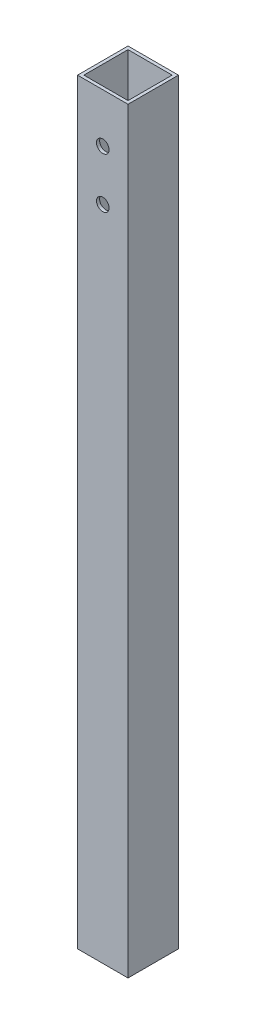
ISO-10303-21;
HEADER;
FILE_DESCRIPTION(('STEP AP214'),'2;1');
FILE_NAME('part.step','',(''),(''),'','','');
FILE_SCHEMA(('AUTOMOTIVE_DESIGN { 1 0 10303 214 1 1 1 1 }'));
ENDSEC;
DATA;
#1=APPLICATION_CONTEXT('core data for automotive mechanical design processes');
#2=APPLICATION_PROTOCOL_DEFINITION('international standard','automotive_design',2000,#1);
#3=PRODUCT_CONTEXT('',#1,'mechanical');
#4=PRODUCT('Part','Part','',(#3));
#5=PRODUCT_RELATED_PRODUCT_CATEGORY('part','',(#4));
#6=PRODUCT_DEFINITION_FORMATION('','',#4);
#7=PRODUCT_DEFINITION_CONTEXT('part definition',#1,'design');
#8=PRODUCT_DEFINITION('design','',#6,#7);
#9=PRODUCT_DEFINITION_SHAPE('','',#8);
#10=(LENGTH_UNIT() NAMED_UNIT(*) SI_UNIT(.MILLI.,.METRE.));
#11=(NAMED_UNIT(*) PLANE_ANGLE_UNIT() SI_UNIT($,.RADIAN.));
#12=(NAMED_UNIT(*) SI_UNIT($,.STERADIAN.) SOLID_ANGLE_UNIT());
#13=UNCERTAINTY_MEASURE_WITH_UNIT(LENGTH_MEASURE(1.E-05),#10,'distance_accuracy_value','');
#14=(GEOMETRIC_REPRESENTATION_CONTEXT(3) GLOBAL_UNCERTAINTY_ASSIGNED_CONTEXT((#13)) GLOBAL_UNIT_ASSIGNED_CONTEXT((#10,
#11,#12)) REPRESENTATION_CONTEXT('',''));
#15=CARTESIAN_POINT('',(0.,0.,0.));
#16=DIRECTION('',(0.,0.,1.));
#17=DIRECTION('',(1.,0.,0.));
#18=AXIS2_PLACEMENT_3D('',#15,#16,#17);
#19=CARTESIAN_POINT('',(0.,381.,0.));
#20=DIRECTION('',(0.,1.,0.));
#21=DIRECTION('',(0.,0.,1.));
#22=AXIS2_PLACEMENT_3D('',#19,#20,#21);
#23=PLANE('',#22);
#24=DIRECTION('',(0.,0.,-1.));
#25=VECTOR('',#24,1.);
#26=CARTESIAN_POINT('',(12.7,381.,-12.7));
#27=LINE('',#26,#25);
#28=CARTESIAN_POINT('',(12.7,381.,12.7));
#29=VERTEX_POINT('',#28);
#30=CARTESIAN_POINT('',(12.7,381.,-12.7));
#31=VERTEX_POINT('',#30);
#32=EDGE_CURVE('E139',#29,#31,#27,.T.);
#33=ORIENTED_EDGE('',*,*,#32,.T.);
#34=DIRECTION('',(-1.,0.,0.));
#35=VECTOR('',#34,1.);
#36=CARTESIAN_POINT('',(-12.7,381.,-12.7));
#37=LINE('',#36,#35);
#38=CARTESIAN_POINT('',(-12.7,381.,-12.7));
#39=VERTEX_POINT('',#38);
#40=EDGE_CURVE('E142',#31,#39,#37,.T.);
#41=ORIENTED_EDGE('',*,*,#40,.T.);
#42=DIRECTION('',(0.,0.,1.));
#43=VECTOR('',#42,1.);
#44=CARTESIAN_POINT('',(-12.7,381.,-12.7));
#45=LINE('',#44,#43);
#46=CARTESIAN_POINT('',(-12.7,381.,12.7));
#47=VERTEX_POINT('',#46);
#48=EDGE_CURVE('E145',#39,#47,#45,.T.);
#49=ORIENTED_EDGE('',*,*,#48,.T.);
#50=DIRECTION('',(1.,0.,0.));
#51=VECTOR('',#50,1.);
#52=CARTESIAN_POINT('',(-12.7,381.,12.7));
#53=LINE('',#52,#51);
#54=EDGE_CURVE('E147',#47,#29,#53,.T.);
#55=ORIENTED_EDGE('',*,*,#54,.T.);
#56=EDGE_LOOP('',(#33,#41,#49,#55));
#57=FACE_BOUND('',#56,.T.);
#58=DIRECTION('',(1.,0.,0.));
#59=VECTOR('',#58,1.);
#60=CARTESIAN_POINT('',(-11.1125,381.,11.1125));
#61=LINE('',#60,#59);
#62=CARTESIAN_POINT('',(-11.1125,381.,11.1125));
#63=VERTEX_POINT('',#62);
#64=CARTESIAN_POINT('',(11.1125,381.,11.1125));
#65=VERTEX_POINT('',#64);
#66=EDGE_CURVE('E109',#63,#65,#61,.T.);
#67=ORIENTED_EDGE('',*,*,#66,.F.);
#68=DIRECTION('',(0.,0.,1.));
#69=VECTOR('',#68,1.);
#70=CARTESIAN_POINT('',(-11.1125,381.,-11.1125));
#71=LINE('',#70,#69);
#72=CARTESIAN_POINT('',(-11.1125,381.,-11.1125));
#73=VERTEX_POINT('',#72);
#74=EDGE_CURVE('E101',#73,#63,#71,.T.);
#75=ORIENTED_EDGE('',*,*,#74,.F.);
#76=DIRECTION('',(-1.,0.,0.));
#77=VECTOR('',#76,1.);
#78=CARTESIAN_POINT('',(-11.1125,381.,-11.1125));
#79=LINE('',#78,#77);
#80=CARTESIAN_POINT('',(11.1125,381.,-11.1125));
#81=VERTEX_POINT('',#80);
#82=EDGE_CURVE('E123',#81,#73,#79,.T.);
#83=ORIENTED_EDGE('',*,*,#82,.F.);
#84=DIRECTION('',(0.,0.,-1.));
#85=VECTOR('',#84,1.);
#86=CARTESIAN_POINT('',(11.1125,381.,-11.1125));
#87=LINE('',#86,#85);
#88=EDGE_CURVE('E121',#65,#81,#87,.T.);
#89=ORIENTED_EDGE('',*,*,#88,.F.);
#90=EDGE_LOOP('',(#67,#75,#83,#89));
#91=FACE_BOUND('',#90,.T.);
#92=ADVANCED_FACE('F34',(#57,#91),#23,.T.);
#93=CARTESIAN_POINT('',(0.,0.,0.));
#94=DIRECTION('',(0.,1.,0.));
#95=DIRECTION('',(0.,0.,1.));
#96=AXIS2_PLACEMENT_3D('',#93,#94,#95);
#97=PLANE('',#96);
#98=DIRECTION('',(0.,0.,-1.));
#99=VECTOR('',#98,1.);
#100=CARTESIAN_POINT('',(12.7,0.,-12.7));
#101=LINE('',#100,#99);
#102=CARTESIAN_POINT('',(12.7,0.,12.7));
#103=VERTEX_POINT('',#102);
#104=CARTESIAN_POINT('',(12.7,0.,-12.7));
#105=VERTEX_POINT('',#104);
#106=EDGE_CURVE('E117',#103,#105,#101,.T.);
#107=ORIENTED_EDGE('',*,*,#106,.F.);
#108=DIRECTION('',(1.,0.,0.));
#109=VECTOR('',#108,1.);
#110=CARTESIAN_POINT('',(-12.7,0.,12.7));
#111=LINE('',#110,#109);
#112=CARTESIAN_POINT('',(-12.7,0.,12.7));
#113=VERTEX_POINT('',#112);
#114=EDGE_CURVE('E143',#113,#103,#111,.T.);
#115=ORIENTED_EDGE('',*,*,#114,.F.);
#116=DIRECTION('',(0.,0.,1.));
#117=VECTOR('',#116,1.);
#118=CARTESIAN_POINT('',(-12.7,0.,-12.7));
#119=LINE('',#118,#117);
#120=CARTESIAN_POINT('',(-12.7,0.,-12.7));
#121=VERTEX_POINT('',#120);
#122=EDGE_CURVE('E154',#121,#113,#119,.T.);
#123=ORIENTED_EDGE('',*,*,#122,.F.);
#124=DIRECTION('',(-1.,0.,0.));
#125=VECTOR('',#124,1.);
#126=CARTESIAN_POINT('',(-12.7,0.,-12.7));
#127=LINE('',#126,#125);
#128=EDGE_CURVE('E152',#105,#121,#127,.T.);
#129=ORIENTED_EDGE('',*,*,#128,.F.);
#130=EDGE_LOOP('',(#107,#115,#123,#129));
#131=FACE_BOUND('',#130,.T.);
#132=DIRECTION('',(0.,0.,1.));
#133=VECTOR('',#132,1.);
#134=CARTESIAN_POINT('',(-11.1125,0.,-11.1125));
#135=LINE('',#134,#133);
#136=CARTESIAN_POINT('',(-11.1125,0.,-11.1125));
#137=VERTEX_POINT('',#136);
#138=CARTESIAN_POINT('',(-11.1125,0.,11.1125));
#139=VERTEX_POINT('',#138);
#140=EDGE_CURVE('E59',#137,#139,#135,.T.);
#141=ORIENTED_EDGE('',*,*,#140,.T.);
#142=DIRECTION('',(1.,0.,0.));
#143=VECTOR('',#142,1.);
#144=CARTESIAN_POINT('',(-11.1125,0.,11.1125));
#145=LINE('',#144,#143);
#146=CARTESIAN_POINT('',(11.1125,0.,11.1125));
#147=VERTEX_POINT('',#146);
#148=EDGE_CURVE('E116',#139,#147,#145,.T.);
#149=ORIENTED_EDGE('',*,*,#148,.T.);
#150=DIRECTION('',(0.,0.,-1.));
#151=VECTOR('',#150,1.);
#152=CARTESIAN_POINT('',(11.1125,0.,-11.1125));
#153=LINE('',#152,#151);
#154=CARTESIAN_POINT('',(11.1125,0.,-11.1125));
#155=VERTEX_POINT('',#154);
#156=EDGE_CURVE('E131',#147,#155,#153,.T.);
#157=ORIENTED_EDGE('',*,*,#156,.T.);
#158=DIRECTION('',(-1.,0.,0.));
#159=VECTOR('',#158,1.);
#160=CARTESIAN_POINT('',(-11.1125,0.,-11.1125));
#161=LINE('',#160,#159);
#162=EDGE_CURVE('E110',#155,#137,#161,.T.);
#163=ORIENTED_EDGE('',*,*,#162,.T.);
#164=EDGE_LOOP('',(#141,#149,#157,#163));
#165=FACE_BOUND('',#164,.T.);
#166=ADVANCED_FACE('F201',(#131,#165),#97,.F.);
#167=CARTESIAN_POINT('',(12.7,381.,-12.7));
#168=DIRECTION('',(-1.,0.,0.));
#169=DIRECTION('',(0.,0.,1.));
#170=AXIS2_PLACEMENT_3D('',#167,#168,#169);
#171=PLANE('',#170);
#172=ORIENTED_EDGE('',*,*,#106,.T.);
#173=DIRECTION('',(0.,-1.,0.));
#174=VECTOR('',#173,1.);
#175=CARTESIAN_POINT('',(12.7,381.,-12.7));
#176=LINE('',#175,#174);
#177=EDGE_CURVE('E11',#31,#105,#176,.T.);
#178=ORIENTED_EDGE('',*,*,#177,.F.);
#179=ORIENTED_EDGE('',*,*,#32,.F.);
#180=DIRECTION('',(0.,-1.,0.));
#181=VECTOR('',#180,1.);
#182=CARTESIAN_POINT('',(12.7,381.,12.7));
#183=LINE('',#182,#181);
#184=EDGE_CURVE('E149',#29,#103,#183,.T.);
#185=ORIENTED_EDGE('',*,*,#184,.T.);
#186=EDGE_LOOP('',(#172,#178,#179,#185));
#187=FACE_BOUND('',#186,.T.);
#188=ADVANCED_FACE('F36',(#187),#171,.F.);
#189=CARTESIAN_POINT('',(-12.7,381.,-12.7));
#190=DIRECTION('',(0.,0.,1.));
#191=DIRECTION('',(1.,0.,0.));
#192=AXIS2_PLACEMENT_3D('',#189,#190,#191);
#193=PLANE('',#192);
#194=CARTESIAN_POINT('',(0.,330.962,-12.7));
#195=DIRECTION('',(0.,0.,1.));
#196=DIRECTION('',(1.,0.,0.));
#197=AXIS2_PLACEMENT_3D('',#194,#195,#196);
#198=CIRCLE('',#197,3.175);
#199=CARTESIAN_POINT('',(3.175,330.962,-12.7));
#200=VERTEX_POINT('',#199);
#201=EDGE_CURVE('E183',#200,#200,#198,.T.);
#202=ORIENTED_EDGE('',*,*,#201,.T.);
#203=EDGE_LOOP('',(#202));
#204=FACE_BOUND('',#203,.T.);
#205=CARTESIAN_POINT('',(0.,356.362,-12.7));
#206=DIRECTION('',(0.,0.,1.));
#207=DIRECTION('',(1.,0.,0.));
#208=AXIS2_PLACEMENT_3D('',#205,#206,#207);
#209=CIRCLE('',#208,3.175);
#210=CARTESIAN_POINT('',(3.175,356.362,-12.7));
#211=VERTEX_POINT('',#210);
#212=EDGE_CURVE('E165',#211,#211,#209,.T.);
#213=ORIENTED_EDGE('',*,*,#212,.T.);
#214=EDGE_LOOP('',(#213));
#215=FACE_BOUND('',#214,.T.);
#216=ORIENTED_EDGE('',*,*,#128,.T.);
#217=DIRECTION('',(0.,-1.,0.));
#218=VECTOR('',#217,1.);
#219=CARTESIAN_POINT('',(-12.7,381.,-12.7));
#220=LINE('',#219,#218);
#221=EDGE_CURVE('E43',#39,#121,#220,.T.);
#222=ORIENTED_EDGE('',*,*,#221,.F.);
#223=ORIENTED_EDGE('',*,*,#40,.F.);
#224=ORIENTED_EDGE('',*,*,#177,.T.);
#225=EDGE_LOOP('',(#216,#222,#223,#224));
#226=FACE_BOUND('',#225,.T.);
#227=ADVANCED_FACE('F228',(#204,#215,#226),#193,.F.);
#228=CARTESIAN_POINT('',(-12.7,381.,-12.7));
#229=DIRECTION('',(1.,0.,0.));
#230=DIRECTION('',(0.,0.,-1.));
#231=AXIS2_PLACEMENT_3D('',#228,#229,#230);
#232=PLANE('',#231);
#233=ORIENTED_EDGE('',*,*,#122,.T.);
#234=DIRECTION('',(0.,-1.,0.));
#235=VECTOR('',#234,1.);
#236=CARTESIAN_POINT('',(-12.7,381.,12.7));
#237=LINE('',#236,#235);
#238=EDGE_CURVE('E159',#47,#113,#237,.T.);
#239=ORIENTED_EDGE('',*,*,#238,.F.);
#240=ORIENTED_EDGE('',*,*,#48,.F.);
#241=ORIENTED_EDGE('',*,*,#221,.T.);
#242=EDGE_LOOP('',(#233,#239,#240,#241));
#243=FACE_BOUND('',#242,.T.);
#244=ADVANCED_FACE('F225',(#243),#232,.F.);
#245=CARTESIAN_POINT('',(-12.7,381.,12.7));
#246=DIRECTION('',(0.,0.,-1.));
#247=DIRECTION('',(-1.,0.,0.));
#248=AXIS2_PLACEMENT_3D('',#245,#246,#247);
#249=PLANE('',#248);
#250=CARTESIAN_POINT('',(0.,330.962,12.7));
#251=DIRECTION('',(0.,0.,1.));
#252=DIRECTION('',(1.,0.,0.));
#253=AXIS2_PLACEMENT_3D('',#250,#251,#252);
#254=CIRCLE('',#253,3.175);
#255=CARTESIAN_POINT('',(3.175,330.962,12.7));
#256=VERTEX_POINT('',#255);
#257=EDGE_CURVE('E180',#256,#256,#254,.T.);
#258=ORIENTED_EDGE('',*,*,#257,.F.);
#259=EDGE_LOOP('',(#258));
#260=FACE_BOUND('',#259,.T.);
#261=CARTESIAN_POINT('',(0.,356.362,12.7));
#262=DIRECTION('',(0.,0.,1.));
#263=DIRECTION('',(1.,0.,0.));
#264=AXIS2_PLACEMENT_3D('',#261,#262,#263);
#265=CIRCLE('',#264,3.175);
#266=CARTESIAN_POINT('',(3.175,356.362,12.7));
#267=VERTEX_POINT('',#266);
#268=EDGE_CURVE('E170',#267,#267,#265,.T.);
#269=ORIENTED_EDGE('',*,*,#268,.F.);
#270=EDGE_LOOP('',(#269));
#271=FACE_BOUND('',#270,.T.);
#272=ORIENTED_EDGE('',*,*,#114,.T.);
#273=ORIENTED_EDGE('',*,*,#184,.F.);
#274=ORIENTED_EDGE('',*,*,#54,.F.);
#275=ORIENTED_EDGE('',*,*,#238,.T.);
#276=EDGE_LOOP('',(#272,#273,#274,#275));
#277=FACE_BOUND('',#276,.T.);
#278=ADVANCED_FACE('F222',(#260,#271,#277),#249,.F.);
#279=CARTESIAN_POINT('',(-11.1125,381.,-11.1125));
#280=DIRECTION('',(1.,0.,0.));
#281=DIRECTION('',(0.,0.,-1.));
#282=AXIS2_PLACEMENT_3D('',#279,#280,#281);
#283=PLANE('',#282);
#284=ORIENTED_EDGE('',*,*,#140,.F.);
#285=DIRECTION('',(0.,-1.,0.));
#286=VECTOR('',#285,1.);
#287=CARTESIAN_POINT('',(-11.1125,381.,-11.1125));
#288=LINE('',#287,#286);
#289=EDGE_CURVE('E105',#73,#137,#288,.T.);
#290=ORIENTED_EDGE('',*,*,#289,.F.);
#291=ORIENTED_EDGE('',*,*,#74,.T.);
#292=DIRECTION('',(0.,-1.,0.));
#293=VECTOR('',#292,1.);
#294=CARTESIAN_POINT('',(-11.1125,381.,11.1125));
#295=LINE('',#294,#293);
#296=EDGE_CURVE('E104',#63,#139,#295,.T.);
#297=ORIENTED_EDGE('',*,*,#296,.T.);
#298=EDGE_LOOP('',(#284,#290,#291,#297));
#299=FACE_BOUND('',#298,.T.);
#300=ADVANCED_FACE('F103',(#299),#283,.T.);
#301=CARTESIAN_POINT('',(-11.1125,381.,11.1125));
#302=DIRECTION('',(0.,0.,-1.));
#303=DIRECTION('',(-1.,0.,0.));
#304=AXIS2_PLACEMENT_3D('',#301,#302,#303);
#305=PLANE('',#304);
#306=CARTESIAN_POINT('',(0.,330.962,11.1125));
#307=DIRECTION('',(0.,0.,-1.));
#308=DIRECTION('',(-1.,0.,0.));
#309=AXIS2_PLACEMENT_3D('',#306,#307,#308);
#310=CIRCLE('',#309,3.175);
#311=CARTESIAN_POINT('',(-3.175,330.962,11.1125));
#312=VERTEX_POINT('',#311);
#313=EDGE_CURVE('E175',#312,#312,#310,.T.);
#314=ORIENTED_EDGE('',*,*,#313,.F.);
#315=EDGE_LOOP('',(#314));
#316=FACE_BOUND('',#315,.T.);
#317=CARTESIAN_POINT('',(0.,356.362,11.1125));
#318=DIRECTION('',(0.,0.,-1.));
#319=DIRECTION('',(-1.,0.,0.));
#320=AXIS2_PLACEMENT_3D('',#317,#318,#319);
#321=CIRCLE('',#320,3.175);
#322=CARTESIAN_POINT('',(-3.175,356.362,11.1125));
#323=VERTEX_POINT('',#322);
#324=EDGE_CURVE('E129',#323,#323,#321,.T.);
#325=ORIENTED_EDGE('',*,*,#324,.F.);
#326=EDGE_LOOP('',(#325));
#327=FACE_BOUND('',#326,.T.);
#328=ORIENTED_EDGE('',*,*,#148,.F.);
#329=ORIENTED_EDGE('',*,*,#296,.F.);
#330=ORIENTED_EDGE('',*,*,#66,.T.);
#331=DIRECTION('',(0.,-1.,0.));
#332=VECTOR('',#331,1.);
#333=CARTESIAN_POINT('',(11.1125,381.,11.1125));
#334=LINE('',#333,#332);
#335=EDGE_CURVE('E118',#65,#147,#334,.T.);
#336=ORIENTED_EDGE('',*,*,#335,.T.);
#337=EDGE_LOOP('',(#328,#329,#330,#336));
#338=FACE_BOUND('',#337,.T.);
#339=ADVANCED_FACE('F113',(#316,#327,#338),#305,.T.);
#340=CARTESIAN_POINT('',(11.1125,381.,-11.1125));
#341=DIRECTION('',(-1.,0.,0.));
#342=DIRECTION('',(0.,0.,1.));
#343=AXIS2_PLACEMENT_3D('',#340,#341,#342);
#344=PLANE('',#343);
#345=ORIENTED_EDGE('',*,*,#156,.F.);
#346=ORIENTED_EDGE('',*,*,#335,.F.);
#347=ORIENTED_EDGE('',*,*,#88,.T.);
#348=DIRECTION('',(0.,-1.,0.));
#349=VECTOR('',#348,1.);
#350=CARTESIAN_POINT('',(11.1125,381.,-11.1125));
#351=LINE('',#350,#349);
#352=EDGE_CURVE('E51',#81,#155,#351,.T.);
#353=ORIENTED_EDGE('',*,*,#352,.T.);
#354=EDGE_LOOP('',(#345,#346,#347,#353));
#355=FACE_BOUND('',#354,.T.);
#356=ADVANCED_FACE('F197',(#355),#344,.T.);
#357=CARTESIAN_POINT('',(-11.1125,381.,-11.1125));
#358=DIRECTION('',(0.,0.,1.));
#359=DIRECTION('',(1.,0.,0.));
#360=AXIS2_PLACEMENT_3D('',#357,#358,#359);
#361=PLANE('',#360);
#362=CARTESIAN_POINT('',(0.,330.962,-11.1125));
#363=DIRECTION('',(0.,0.,1.));
#364=DIRECTION('',(1.,0.,0.));
#365=AXIS2_PLACEMENT_3D('',#362,#363,#364);
#366=CIRCLE('',#365,3.175);
#367=CARTESIAN_POINT('',(3.175,330.962,-11.1125));
#368=VERTEX_POINT('',#367);
#369=EDGE_CURVE('E38',#368,#368,#366,.T.);
#370=ORIENTED_EDGE('',*,*,#369,.F.);
#371=EDGE_LOOP('',(#370));
#372=FACE_BOUND('',#371,.T.);
#373=CARTESIAN_POINT('',(0.,356.362,-11.1125));
#374=DIRECTION('',(0.,0.,1.));
#375=DIRECTION('',(1.,0.,0.));
#376=AXIS2_PLACEMENT_3D('',#373,#374,#375);
#377=CIRCLE('',#376,3.175);
#378=CARTESIAN_POINT('',(3.175,356.362,-11.1125));
#379=VERTEX_POINT('',#378);
#380=EDGE_CURVE('E163',#379,#379,#377,.T.);
#381=ORIENTED_EDGE('',*,*,#380,.F.);
#382=EDGE_LOOP('',(#381));
#383=FACE_BOUND('',#382,.T.);
#384=ORIENTED_EDGE('',*,*,#162,.F.);
#385=ORIENTED_EDGE('',*,*,#352,.F.);
#386=ORIENTED_EDGE('',*,*,#82,.T.);
#387=ORIENTED_EDGE('',*,*,#289,.T.);
#388=EDGE_LOOP('',(#384,#385,#386,#387));
#389=FACE_BOUND('',#388,.T.);
#390=ADVANCED_FACE('F193',(#372,#383,#389),#361,.T.);
#391=CARTESIAN_POINT('',(0.,356.362,-12.7));
#392=DIRECTION('',(0.,0.,1.));
#393=DIRECTION('',(1.,0.,0.));
#394=AXIS2_PLACEMENT_3D('',#391,#392,#393);
#395=CYLINDRICAL_SURFACE('',#394,3.175);
#396=ORIENTED_EDGE('',*,*,#380,.T.);
#397=EDGE_LOOP('',(#396));
#398=FACE_BOUND('',#397,.T.);
#399=ORIENTED_EDGE('',*,*,#212,.F.);
#400=EDGE_LOOP('',(#399));
#401=FACE_BOUND('',#400,.T.);
#402=ADVANCED_FACE('F196',(#398,#401),#395,.F.);
#403=ORIENTED_EDGE('',*,*,#324,.T.);
#404=EDGE_LOOP('',(#403));
#405=FACE_BOUND('',#404,.T.);
#406=ORIENTED_EDGE('',*,*,#268,.T.);
#407=EDGE_LOOP('',(#406));
#408=FACE_BOUND('',#407,.T.);
#409=ADVANCED_FACE('F286',(#405,#408),#395,.F.);
#410=CARTESIAN_POINT('',(0.,330.962,-12.7));
#411=DIRECTION('',(0.,0.,1.));
#412=DIRECTION('',(1.,0.,0.));
#413=AXIS2_PLACEMENT_3D('',#410,#411,#412);
#414=CYLINDRICAL_SURFACE('',#413,3.175);
#415=ORIENTED_EDGE('',*,*,#369,.T.);
#416=EDGE_LOOP('',(#415));
#417=FACE_BOUND('',#416,.T.);
#418=ORIENTED_EDGE('',*,*,#201,.F.);
#419=EDGE_LOOP('',(#418));
#420=FACE_BOUND('',#419,.T.);
#421=ADVANCED_FACE('F190',(#417,#420),#414,.F.);
#422=ORIENTED_EDGE('',*,*,#313,.T.);
#423=EDGE_LOOP('',(#422));
#424=FACE_BOUND('',#423,.T.);
#425=ORIENTED_EDGE('',*,*,#257,.T.);
#426=EDGE_LOOP('',(#425));
#427=FACE_BOUND('',#426,.T.);
#428=ADVANCED_FACE('F303',(#424,#427),#414,.F.);
#429=CLOSED_SHELL('',(#92,#166,#188,#227,#244,#278,#300,#339,#356,#390,#402,#409,#421,#428));
#430=MANIFOLD_SOLID_BREP('B2',#429);
#431=ADVANCED_BREP_SHAPE_REPRESENTATION('',(#18,#430),#14);
#432=SHAPE_DEFINITION_REPRESENTATION(#9,#431);
ENDSEC;
END-ISO-10303-21;
